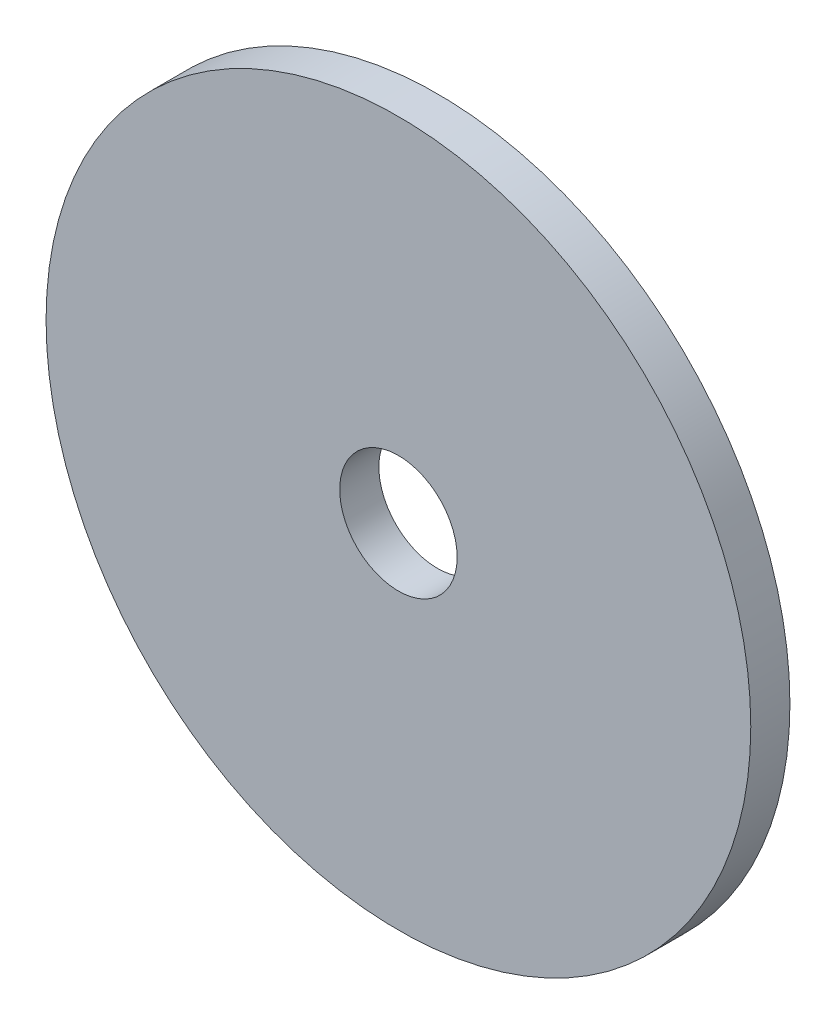
ISO-10303-21;
HEADER;
FILE_DESCRIPTION(('STEP AP214'),'2;1');
FILE_NAME('part.step','',(''),(''),'','','');
FILE_SCHEMA(('AUTOMOTIVE_DESIGN { 1 0 10303 214 1 1 1 1 }'));
ENDSEC;
DATA;
#1=APPLICATION_CONTEXT('core data for automotive mechanical design processes');
#2=APPLICATION_PROTOCOL_DEFINITION('international standard','automotive_design',2000,#1);
#3=PRODUCT_CONTEXT('',#1,'mechanical');
#4=PRODUCT('Part','Part','',(#3));
#5=PRODUCT_RELATED_PRODUCT_CATEGORY('part','',(#4));
#6=PRODUCT_DEFINITION_FORMATION('','',#4);
#7=PRODUCT_DEFINITION_CONTEXT('part definition',#1,'design');
#8=PRODUCT_DEFINITION('design','',#6,#7);
#9=PRODUCT_DEFINITION_SHAPE('','',#8);
#10=(LENGTH_UNIT() NAMED_UNIT(*) SI_UNIT(.MILLI.,.METRE.));
#11=(NAMED_UNIT(*) PLANE_ANGLE_UNIT() SI_UNIT($,.RADIAN.));
#12=(NAMED_UNIT(*) SI_UNIT($,.STERADIAN.) SOLID_ANGLE_UNIT());
#13=UNCERTAINTY_MEASURE_WITH_UNIT(LENGTH_MEASURE(1.E-05),#10,'distance_accuracy_value','');
#14=(GEOMETRIC_REPRESENTATION_CONTEXT(3) GLOBAL_UNCERTAINTY_ASSIGNED_CONTEXT((#13)) GLOBAL_UNIT_ASSIGNED_CONTEXT((#10,
#11,#12)) REPRESENTATION_CONTEXT('',''));
#15=CARTESIAN_POINT('',(0.,0.,0.));
#16=DIRECTION('',(0.,0.,1.));
#17=DIRECTION('',(1.,0.,0.));
#18=AXIS2_PLACEMENT_3D('',#15,#16,#17);
#19=CARTESIAN_POINT('',(0.,0.,2.));
#20=DIRECTION('',(0.,0.,1.));
#21=DIRECTION('',(1.,0.,0.));
#22=AXIS2_PLACEMENT_3D('',#19,#20,#21);
#23=PLANE('',#22);
#24=CARTESIAN_POINT('',(0.,0.,2.));
#25=DIRECTION('',(0.,0.,1.));
#26=DIRECTION('',(1.,0.,0.));
#27=AXIS2_PLACEMENT_3D('',#24,#25,#26);
#28=CIRCLE('',#27,18.);
#29=CARTESIAN_POINT('',(18.,0.,2.));
#30=VERTEX_POINT('',#29);
#31=EDGE_CURVE('E10',#30,#30,#28,.T.);
#32=ORIENTED_EDGE('',*,*,#31,.T.);
#33=EDGE_LOOP('',(#32));
#34=FACE_BOUND('',#33,.T.);
#35=CARTESIAN_POINT('',(0.,0.,2.));
#36=DIRECTION('',(0.,0.,1.));
#37=DIRECTION('',(1.,0.,0.));
#38=AXIS2_PLACEMENT_3D('',#35,#36,#37);
#39=CIRCLE('',#38,3.);
#40=CARTESIAN_POINT('',(3.,0.,2.));
#41=VERTEX_POINT('',#40);
#42=EDGE_CURVE('E50',#41,#41,#39,.T.);
#43=ORIENTED_EDGE('',*,*,#42,.F.);
#44=EDGE_LOOP('',(#43));
#45=FACE_BOUND('',#44,.T.);
#46=ADVANCED_FACE('F37',(#34,#45),#23,.T.);
#47=CARTESIAN_POINT('',(0.,0.,0.));
#48=DIRECTION('',(0.,0.,1.));
#49=DIRECTION('',(1.,0.,0.));
#50=AXIS2_PLACEMENT_3D('',#47,#48,#49);
#51=PLANE('',#50);
#52=CARTESIAN_POINT('',(0.,0.,0.));
#53=DIRECTION('',(0.,0.,1.));
#54=DIRECTION('',(1.,0.,0.));
#55=AXIS2_PLACEMENT_3D('',#52,#53,#54);
#56=CIRCLE('',#55,18.);
#57=CARTESIAN_POINT('',(18.,0.,0.));
#58=VERTEX_POINT('',#57);
#59=EDGE_CURVE('E41',#58,#58,#56,.T.);
#60=ORIENTED_EDGE('',*,*,#59,.F.);
#61=EDGE_LOOP('',(#60));
#62=FACE_BOUND('',#61,.T.);
#63=CARTESIAN_POINT('',(0.,0.,0.));
#64=DIRECTION('',(0.,0.,1.));
#65=DIRECTION('',(1.,0.,0.));
#66=AXIS2_PLACEMENT_3D('',#63,#64,#65);
#67=CIRCLE('',#66,3.);
#68=CARTESIAN_POINT('',(3.,0.,0.));
#69=VERTEX_POINT('',#68);
#70=EDGE_CURVE('E52',#69,#69,#67,.T.);
#71=ORIENTED_EDGE('',*,*,#70,.T.);
#72=EDGE_LOOP('',(#71));
#73=FACE_BOUND('',#72,.T.);
#74=ADVANCED_FACE('F64',(#62,#73),#51,.F.);
#75=CARTESIAN_POINT('',(0.,0.,2.));
#76=DIRECTION('',(0.,0.,-1.));
#77=DIRECTION('',(-1.,0.,0.));
#78=AXIS2_PLACEMENT_3D('',#75,#76,#77);
#79=CYLINDRICAL_SURFACE('',#78,18.);
#80=ORIENTED_EDGE('',*,*,#31,.F.);
#81=EDGE_LOOP('',(#80));
#82=FACE_BOUND('',#81,.T.);
#83=ORIENTED_EDGE('',*,*,#59,.T.);
#84=EDGE_LOOP('',(#83));
#85=FACE_BOUND('',#84,.T.);
#86=ADVANCED_FACE('F39',(#82,#85),#79,.T.);
#87=CARTESIAN_POINT('',(0.,0.,2.));
#88=DIRECTION('',(0.,0.,-1.));
#89=DIRECTION('',(-1.,0.,0.));
#90=AXIS2_PLACEMENT_3D('',#87,#88,#89);
#91=CYLINDRICAL_SURFACE('',#90,3.);
#92=ORIENTED_EDGE('',*,*,#42,.T.);
#93=EDGE_LOOP('',(#92));
#94=FACE_BOUND('',#93,.T.);
#95=ORIENTED_EDGE('',*,*,#70,.F.);
#96=EDGE_LOOP('',(#95));
#97=FACE_BOUND('',#96,.T.);
#98=ADVANCED_FACE('F60',(#94,#97),#91,.F.);
#99=CLOSED_SHELL('',(#46,#74,#86,#98));
#100=MANIFOLD_SOLID_BREP('B2',#99);
#101=ADVANCED_BREP_SHAPE_REPRESENTATION('',(#18,#100),#14);
#102=SHAPE_DEFINITION_REPRESENTATION(#9,#101);
ENDSEC;
END-ISO-10303-21;
